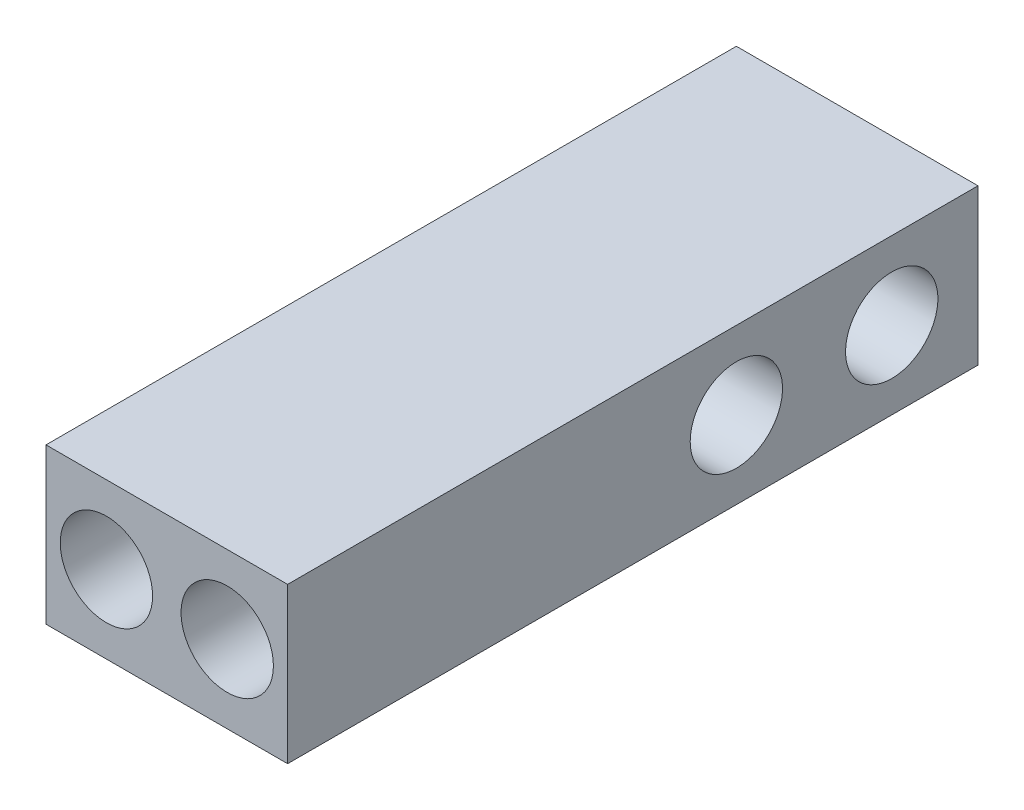
ISO-10303-21;
HEADER;
FILE_DESCRIPTION(('STEP AP214'),'2;1');
FILE_NAME('part.step','',(''),(''),'','','');
FILE_SCHEMA(('AUTOMOTIVE_DESIGN { 1 0 10303 214 1 1 1 1 }'));
ENDSEC;
DATA;
#1=APPLICATION_CONTEXT('core data for automotive mechanical design processes');
#2=APPLICATION_PROTOCOL_DEFINITION('international standard','automotive_design',2000,#1);
#3=PRODUCT_CONTEXT('',#1,'mechanical');
#4=PRODUCT('Part','Part','',(#3));
#5=PRODUCT_RELATED_PRODUCT_CATEGORY('part','',(#4));
#6=PRODUCT_DEFINITION_FORMATION('','',#4);
#7=PRODUCT_DEFINITION_CONTEXT('part definition',#1,'design');
#8=PRODUCT_DEFINITION('design','',#6,#7);
#9=PRODUCT_DEFINITION_SHAPE('','',#8);
#10=(LENGTH_UNIT() NAMED_UNIT(*) SI_UNIT(.MILLI.,.METRE.));
#11=(NAMED_UNIT(*) PLANE_ANGLE_UNIT() SI_UNIT($,.RADIAN.));
#12=(NAMED_UNIT(*) SI_UNIT($,.STERADIAN.) SOLID_ANGLE_UNIT());
#13=UNCERTAINTY_MEASURE_WITH_UNIT(LENGTH_MEASURE(1.E-05),#10,'distance_accuracy_value','');
#14=(GEOMETRIC_REPRESENTATION_CONTEXT(3) GLOBAL_UNCERTAINTY_ASSIGNED_CONTEXT((#13)) GLOBAL_UNIT_ASSIGNED_CONTEXT((#10,
#11,#12)) REPRESENTATION_CONTEXT('',''));
#15=CARTESIAN_POINT('',(0.,0.,0.));
#16=DIRECTION('',(0.,0.,1.));
#17=DIRECTION('',(1.,0.,0.));
#18=AXIS2_PLACEMENT_3D('',#15,#16,#17);
#19=CARTESIAN_POINT('',(7.,9.,20.));
#20=DIRECTION('',(-1.,0.,0.));
#21=DIRECTION('',(0.,0.,1.));
#22=AXIS2_PLACEMENT_3D('',#19,#20,#21);
#23=PLANE('',#22);
#24=CARTESIAN_POINT('',(7.,4.5,-5.99999999999999));
#25=DIRECTION('',(-1.,0.,0.));
#26=DIRECTION('',(0.,0.,1.));
#27=AXIS2_PLACEMENT_3D('',#24,#25,#26);
#28=CIRCLE('',#27,2.675);
#29=CARTESIAN_POINT('',(7.,4.5,-3.32499999999999));
#30=VERTEX_POINT('',#29);
#31=EDGE_CURVE('E124',#30,#30,#28,.T.);
#32=ORIENTED_EDGE('',*,*,#31,.T.);
#33=EDGE_LOOP('',(#32));
#34=FACE_BOUND('',#33,.T.);
#35=CARTESIAN_POINT('',(7.,4.5,-15.));
#36=DIRECTION('',(-1.,0.,0.));
#37=DIRECTION('',(0.,0.,1.));
#38=AXIS2_PLACEMENT_3D('',#35,#36,#37);
#39=CIRCLE('',#38,2.675);
#40=CARTESIAN_POINT('',(7.,4.5,-12.325));
#41=VERTEX_POINT('',#40);
#42=EDGE_CURVE('E118',#41,#41,#39,.T.);
#43=ORIENTED_EDGE('',*,*,#42,.T.);
#44=EDGE_LOOP('',(#43));
#45=FACE_BOUND('',#44,.T.);
#46=DIRECTION('',(0.,0.,-1.));
#47=VECTOR('',#46,1.);
#48=CARTESIAN_POINT('',(7.,0.,20.));
#49=LINE('',#48,#47);
#50=CARTESIAN_POINT('',(7.,0.,20.));
#51=VERTEX_POINT('',#50);
#52=CARTESIAN_POINT('',(7.,0.,-20.));
#53=VERTEX_POINT('',#52);
#54=EDGE_CURVE('E95',#51,#53,#49,.T.);
#55=ORIENTED_EDGE('',*,*,#54,.T.);
#56=DIRECTION('',(0.,-1.,0.));
#57=VECTOR('',#56,1.);
#58=CARTESIAN_POINT('',(7.,9.,-20.));
#59=LINE('',#58,#57);
#60=CARTESIAN_POINT('',(7.,9.,-20.));
#61=VERTEX_POINT('',#60);
#62=EDGE_CURVE('E11',#61,#53,#59,.T.);
#63=ORIENTED_EDGE('',*,*,#62,.F.);
#64=DIRECTION('',(0.,0.,-1.));
#65=VECTOR('',#64,1.);
#66=CARTESIAN_POINT('',(7.,9.,20.));
#67=LINE('',#66,#65);
#68=CARTESIAN_POINT('',(7.,9.,20.));
#69=VERTEX_POINT('',#68);
#70=EDGE_CURVE('E83',#69,#61,#67,.T.);
#71=ORIENTED_EDGE('',*,*,#70,.F.);
#72=DIRECTION('',(0.,-1.,0.));
#73=VECTOR('',#72,1.);
#74=CARTESIAN_POINT('',(7.,9.,20.));
#75=LINE('',#74,#73);
#76=EDGE_CURVE('E91',#69,#51,#75,.T.);
#77=ORIENTED_EDGE('',*,*,#76,.T.);
#78=EDGE_LOOP('',(#55,#63,#71,#77));
#79=FACE_BOUND('',#78,.T.);
#80=ADVANCED_FACE('F32',(#34,#45,#79),#23,.F.);
#81=CARTESIAN_POINT('',(-7.,9.,-20.));
#82=DIRECTION('',(0.,0.,1.));
#83=DIRECTION('',(1.,0.,0.));
#84=AXIS2_PLACEMENT_3D('',#81,#82,#83);
#85=PLANE('',#84);
#86=DIRECTION('',(-1.,0.,0.));
#87=VECTOR('',#86,1.);
#88=CARTESIAN_POINT('',(-7.,0.,-20.));
#89=LINE('',#88,#87);
#90=CARTESIAN_POINT('',(-7.,0.,-20.));
#91=VERTEX_POINT('',#90);
#92=EDGE_CURVE('E87',#53,#91,#89,.T.);
#93=ORIENTED_EDGE('',*,*,#92,.T.);
#94=DIRECTION('',(0.,-1.,0.));
#95=VECTOR('',#94,1.);
#96=CARTESIAN_POINT('',(-7.,9.,-20.));
#97=LINE('',#96,#95);
#98=CARTESIAN_POINT('',(-7.,9.,-20.));
#99=VERTEX_POINT('',#98);
#100=EDGE_CURVE('E40',#99,#91,#97,.T.);
#101=ORIENTED_EDGE('',*,*,#100,.F.);
#102=DIRECTION('',(-1.,0.,0.));
#103=VECTOR('',#102,1.);
#104=CARTESIAN_POINT('',(-7.,9.,-20.));
#105=LINE('',#104,#103);
#106=EDGE_CURVE('E78',#61,#99,#105,.T.);
#107=ORIENTED_EDGE('',*,*,#106,.F.);
#108=ORIENTED_EDGE('',*,*,#62,.T.);
#109=EDGE_LOOP('',(#93,#101,#107,#108));
#110=FACE_BOUND('',#109,.T.);
#111=ADVANCED_FACE('F86',(#110),#85,.F.);
#112=CARTESIAN_POINT('',(-7.,9.,20.));
#113=DIRECTION('',(1.,0.,0.));
#114=DIRECTION('',(0.,0.,-1.));
#115=AXIS2_PLACEMENT_3D('',#112,#113,#114);
#116=PLANE('',#115);
#117=CARTESIAN_POINT('',(-7.,4.5,-5.99999999999999));
#118=DIRECTION('',(-1.,0.,0.));
#119=DIRECTION('',(0.,0.,1.));
#120=AXIS2_PLACEMENT_3D('',#117,#118,#119);
#121=CIRCLE('',#120,2.675);
#122=CARTESIAN_POINT('',(-7.,4.5,-3.32499999999999));
#123=VERTEX_POINT('',#122);
#124=EDGE_CURVE('E127',#123,#123,#121,.T.);
#125=ORIENTED_EDGE('',*,*,#124,.F.);
#126=EDGE_LOOP('',(#125));
#127=FACE_BOUND('',#126,.T.);
#128=CARTESIAN_POINT('',(-7.,4.5,-15.));
#129=DIRECTION('',(-1.,0.,0.));
#130=DIRECTION('',(0.,0.,1.));
#131=AXIS2_PLACEMENT_3D('',#128,#129,#130);
#132=CIRCLE('',#131,2.675);
#133=CARTESIAN_POINT('',(-7.,4.5,-12.325));
#134=VERTEX_POINT('',#133);
#135=EDGE_CURVE('E121',#134,#134,#132,.T.);
#136=ORIENTED_EDGE('',*,*,#135,.F.);
#137=EDGE_LOOP('',(#136));
#138=FACE_BOUND('',#137,.T.);
#139=DIRECTION('',(0.,0.,1.));
#140=VECTOR('',#139,1.);
#141=CARTESIAN_POINT('',(-7.,0.,20.));
#142=LINE('',#141,#140);
#143=CARTESIAN_POINT('',(-7.,0.,20.));
#144=VERTEX_POINT('',#143);
#145=EDGE_CURVE('E65',#91,#144,#142,.T.);
#146=ORIENTED_EDGE('',*,*,#145,.T.);
#147=DIRECTION('',(0.,-1.,0.));
#148=VECTOR('',#147,1.);
#149=CARTESIAN_POINT('',(-7.,9.,20.));
#150=LINE('',#149,#148);
#151=CARTESIAN_POINT('',(-7.,9.,20.));
#152=VERTEX_POINT('',#151);
#153=EDGE_CURVE('E88',#152,#144,#150,.T.);
#154=ORIENTED_EDGE('',*,*,#153,.F.);
#155=DIRECTION('',(0.,0.,1.));
#156=VECTOR('',#155,1.);
#157=CARTESIAN_POINT('',(-7.,9.,20.));
#158=LINE('',#157,#156);
#159=EDGE_CURVE('E81',#99,#152,#158,.T.);
#160=ORIENTED_EDGE('',*,*,#159,.F.);
#161=ORIENTED_EDGE('',*,*,#100,.T.);
#162=EDGE_LOOP('',(#146,#154,#160,#161));
#163=FACE_BOUND('',#162,.T.);
#164=ADVANCED_FACE('F89',(#127,#138,#163),#116,.F.);
#165=CARTESIAN_POINT('',(-7.,9.,20.));
#166=DIRECTION('',(0.,0.,-1.));
#167=DIRECTION('',(-1.,0.,0.));
#168=AXIS2_PLACEMENT_3D('',#165,#166,#167);
#169=PLANE('',#168);
#170=CARTESIAN_POINT('',(3.5,4.5,20.));
#171=DIRECTION('',(0.,0.,1.));
#172=DIRECTION('',(1.,0.,0.));
#173=AXIS2_PLACEMENT_3D('',#170,#171,#172);
#174=CIRCLE('',#173,2.675);
#175=CARTESIAN_POINT('',(6.175,4.5,20.));
#176=VERTEX_POINT('',#175);
#177=EDGE_CURVE('E115',#176,#176,#174,.T.);
#178=ORIENTED_EDGE('',*,*,#177,.F.);
#179=EDGE_LOOP('',(#178));
#180=FACE_BOUND('',#179,.T.);
#181=CARTESIAN_POINT('',(-3.5,4.5,20.));
#182=DIRECTION('',(0.,0.,1.));
#183=DIRECTION('',(1.,0.,0.));
#184=AXIS2_PLACEMENT_3D('',#181,#182,#183);
#185=CIRCLE('',#184,2.675);
#186=CARTESIAN_POINT('',(-0.825000000000001,4.5,20.));
#187=VERTEX_POINT('',#186);
#188=EDGE_CURVE('E109',#187,#187,#185,.T.);
#189=ORIENTED_EDGE('',*,*,#188,.F.);
#190=EDGE_LOOP('',(#189));
#191=FACE_BOUND('',#190,.T.);
#192=DIRECTION('',(1.,0.,0.));
#193=VECTOR('',#192,1.);
#194=CARTESIAN_POINT('',(-7.,0.,20.));
#195=LINE('',#194,#193);
#196=EDGE_CURVE('E71',#144,#51,#195,.T.);
#197=ORIENTED_EDGE('',*,*,#196,.T.);
#198=ORIENTED_EDGE('',*,*,#76,.F.);
#199=DIRECTION('',(1.,0.,0.));
#200=VECTOR('',#199,1.);
#201=CARTESIAN_POINT('',(-7.,9.,20.));
#202=LINE('',#201,#200);
#203=EDGE_CURVE('E48',#152,#69,#202,.T.);
#204=ORIENTED_EDGE('',*,*,#203,.F.);
#205=ORIENTED_EDGE('',*,*,#153,.T.);
#206=EDGE_LOOP('',(#197,#198,#204,#205));
#207=FACE_BOUND('',#206,.T.);
#208=ADVANCED_FACE('F103',(#180,#191,#207),#169,.F.);
#209=CARTESIAN_POINT('',(0.,9.,0.));
#210=DIRECTION('',(0.,-1.,0.));
#211=DIRECTION('',(0.,0.,-1.));
#212=AXIS2_PLACEMENT_3D('',#209,#210,#211);
#213=PLANE('',#212);
#214=ORIENTED_EDGE('',*,*,#70,.T.);
#215=ORIENTED_EDGE('',*,*,#106,.T.);
#216=ORIENTED_EDGE('',*,*,#159,.T.);
#217=ORIENTED_EDGE('',*,*,#203,.T.);
#218=EDGE_LOOP('',(#214,#215,#216,#217));
#219=FACE_BOUND('',#218,.T.);
#220=ADVANCED_FACE('F79',(#219),#213,.F.);
#221=CARTESIAN_POINT('',(0.,0.,0.));
#222=DIRECTION('',(0.,-1.,0.));
#223=DIRECTION('',(0.,0.,-1.));
#224=AXIS2_PLACEMENT_3D('',#221,#222,#223);
#225=PLANE('',#224);
#226=ORIENTED_EDGE('',*,*,#54,.F.);
#227=ORIENTED_EDGE('',*,*,#196,.F.);
#228=ORIENTED_EDGE('',*,*,#145,.F.);
#229=ORIENTED_EDGE('',*,*,#92,.F.);
#230=EDGE_LOOP('',(#226,#227,#228,#229));
#231=FACE_BOUND('',#230,.T.);
#232=ADVANCED_FACE('F106',(#231),#225,.T.);
#233=CARTESIAN_POINT('',(-3.5,4.5,5.));
#234=DIRECTION('',(0.,0.,1.));
#235=DIRECTION('',(1.,0.,0.));
#236=AXIS2_PLACEMENT_3D('',#233,#234,#235);
#237=CYLINDRICAL_SURFACE('',#236,2.675);
#238=CARTESIAN_POINT('',(-3.5,4.5,5.));
#239=DIRECTION('',(0.,0.,1.));
#240=DIRECTION('',(1.,0.,0.));
#241=AXIS2_PLACEMENT_3D('',#238,#239,#240);
#242=CIRCLE('',#241,2.675);
#243=CARTESIAN_POINT('',(-0.825000000000001,4.5,5.));
#244=VERTEX_POINT('',#243);
#245=EDGE_CURVE('E98',#244,#244,#242,.T.);
#246=ORIENTED_EDGE('',*,*,#245,.F.);
#247=EDGE_LOOP('',(#246));
#248=FACE_BOUND('',#247,.T.);
#249=ORIENTED_EDGE('',*,*,#188,.T.);
#250=EDGE_LOOP('',(#249));
#251=FACE_BOUND('',#250,.T.);
#252=ADVANCED_FACE('F170',(#248,#251),#237,.F.);
#253=CARTESIAN_POINT('',(-3.5,4.5,5.));
#254=DIRECTION('',(0.,0.,1.));
#255=DIRECTION('',(1.,0.,0.));
#256=AXIS2_PLACEMENT_3D('',#253,#254,#255);
#257=PLANE('',#256);
#258=ORIENTED_EDGE('',*,*,#245,.T.);
#259=EDGE_LOOP('',(#258));
#260=FACE_BOUND('',#259,.T.);
#261=ADVANCED_FACE('F175',(#260),#257,.T.);
#262=CARTESIAN_POINT('',(3.5,4.5,5.));
#263=DIRECTION('',(0.,0.,1.));
#264=DIRECTION('',(1.,0.,0.));
#265=AXIS2_PLACEMENT_3D('',#262,#263,#264);
#266=CYLINDRICAL_SURFACE('',#265,2.675);
#267=CARTESIAN_POINT('',(3.5,4.5,5.));
#268=DIRECTION('',(0.,0.,1.));
#269=DIRECTION('',(1.,0.,0.));
#270=AXIS2_PLACEMENT_3D('',#267,#268,#269);
#271=CIRCLE('',#270,2.675);
#272=CARTESIAN_POINT('',(6.175,4.5,5.));
#273=VERTEX_POINT('',#272);
#274=EDGE_CURVE('E112',#273,#273,#271,.T.);
#275=ORIENTED_EDGE('',*,*,#274,.F.);
#276=EDGE_LOOP('',(#275));
#277=FACE_BOUND('',#276,.T.);
#278=ORIENTED_EDGE('',*,*,#177,.T.);
#279=EDGE_LOOP('',(#278));
#280=FACE_BOUND('',#279,.T.);
#281=ADVANCED_FACE('F154',(#277,#280),#266,.F.);
#282=CARTESIAN_POINT('',(3.5,4.5,5.));
#283=DIRECTION('',(0.,0.,1.));
#284=DIRECTION('',(1.,0.,0.));
#285=AXIS2_PLACEMENT_3D('',#282,#283,#284);
#286=PLANE('',#285);
#287=ORIENTED_EDGE('',*,*,#274,.T.);
#288=EDGE_LOOP('',(#287));
#289=FACE_BOUND('',#288,.T.);
#290=ADVANCED_FACE('F148',(#289),#286,.T.);
#291=CARTESIAN_POINT('',(7.,4.5,-15.));
#292=DIRECTION('',(-1.,0.,0.));
#293=DIRECTION('',(0.,0.,1.));
#294=AXIS2_PLACEMENT_3D('',#291,#292,#293);
#295=CYLINDRICAL_SURFACE('',#294,2.675);
#296=ORIENTED_EDGE('',*,*,#42,.F.);
#297=EDGE_LOOP('',(#296));
#298=FACE_BOUND('',#297,.T.);
#299=ORIENTED_EDGE('',*,*,#135,.T.);
#300=EDGE_LOOP('',(#299));
#301=FACE_BOUND('',#300,.T.);
#302=ADVANCED_FACE('F138',(#298,#301),#295,.F.);
#303=CARTESIAN_POINT('',(7.,4.5,-5.99999999999999));
#304=DIRECTION('',(-1.,0.,0.));
#305=DIRECTION('',(0.,0.,1.));
#306=AXIS2_PLACEMENT_3D('',#303,#304,#305);
#307=CYLINDRICAL_SURFACE('',#306,2.675);
#308=ORIENTED_EDGE('',*,*,#31,.F.);
#309=EDGE_LOOP('',(#308));
#310=FACE_BOUND('',#309,.T.);
#311=ORIENTED_EDGE('',*,*,#124,.T.);
#312=EDGE_LOOP('',(#311));
#313=FACE_BOUND('',#312,.T.);
#314=ADVANCED_FACE('F135',(#310,#313),#307,.F.);
#315=CLOSED_SHELL('',(#80,#111,#164,#208,#220,#232,#252,#261,#281,#290,#302,#314));
#316=MANIFOLD_SOLID_BREP('B2',#315);
#317=ADVANCED_BREP_SHAPE_REPRESENTATION('',(#18,#316),#14);
#318=SHAPE_DEFINITION_REPRESENTATION(#9,#317);
ENDSEC;
END-ISO-10303-21;
